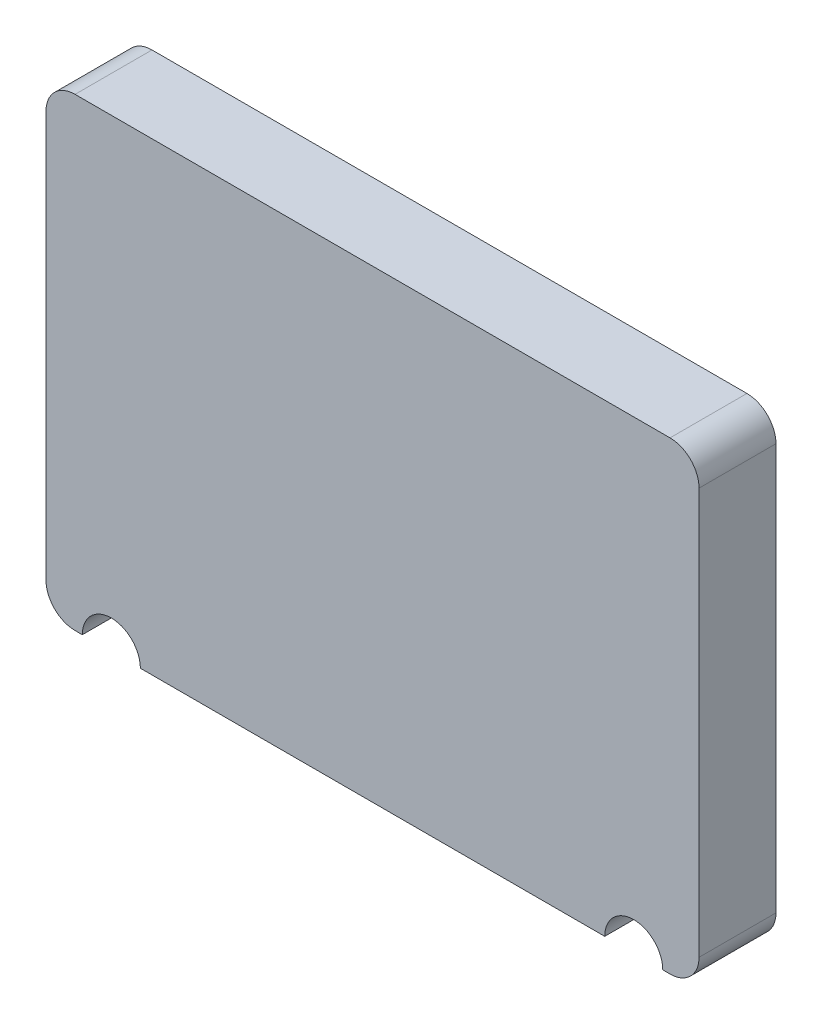
ISO-10303-21;
HEADER;
FILE_DESCRIPTION(('STEP AP214'),'2;1');
FILE_NAME('part.step','',(''),(''),'','','');
FILE_SCHEMA(('AUTOMOTIVE_DESIGN { 1 0 10303 214 1 1 1 1 }'));
ENDSEC;
DATA;
#1=APPLICATION_CONTEXT('core data for automotive mechanical design processes');
#2=APPLICATION_PROTOCOL_DEFINITION('international standard','automotive_design',2000,#1);
#3=PRODUCT_CONTEXT('',#1,'mechanical');
#4=PRODUCT('Part','Part','',(#3));
#5=PRODUCT_RELATED_PRODUCT_CATEGORY('part','',(#4));
#6=PRODUCT_DEFINITION_FORMATION('','',#4);
#7=PRODUCT_DEFINITION_CONTEXT('part definition',#1,'design');
#8=PRODUCT_DEFINITION('design','',#6,#7);
#9=PRODUCT_DEFINITION_SHAPE('','',#8);
#10=(LENGTH_UNIT() NAMED_UNIT(*) SI_UNIT(.MILLI.,.METRE.));
#11=(NAMED_UNIT(*) PLANE_ANGLE_UNIT() SI_UNIT($,.RADIAN.));
#12=(NAMED_UNIT(*) SI_UNIT($,.STERADIAN.) SOLID_ANGLE_UNIT());
#13=UNCERTAINTY_MEASURE_WITH_UNIT(LENGTH_MEASURE(1.E-05),#10,'distance_accuracy_value','');
#14=(GEOMETRIC_REPRESENTATION_CONTEXT(3) GLOBAL_UNCERTAINTY_ASSIGNED_CONTEXT((#13)) GLOBAL_UNIT_ASSIGNED_CONTEXT((#10,
#11,#12)) REPRESENTATION_CONTEXT('',''));
#15=CARTESIAN_POINT('',(0.,0.,0.));
#16=DIRECTION('',(0.,0.,1.));
#17=DIRECTION('',(1.,0.,0.));
#18=AXIS2_PLACEMENT_3D('',#15,#16,#17);
#19=CARTESIAN_POINT('',(-3.,-3.,0.07));
#20=DIRECTION('',(0.,0.,1.));
#21=DIRECTION('',(1.,0.,0.));
#22=AXIS2_PLACEMENT_3D('',#19,#20,#21);
#23=PLANE('',#22);
#24=DIRECTION('',(0.,1.,0.));
#25=VECTOR('',#24,1.);
#26=CARTESIAN_POINT('',(2.25,-1.6,0.07));
#27=LINE('',#26,#25);
#28=CARTESIAN_POINT('',(2.25,-1.4,0.07));
#29=VERTEX_POINT('',#28);
#30=CARTESIAN_POINT('',(2.25,1.4,0.07));
#31=VERTEX_POINT('',#30);
#32=EDGE_CURVE('E132',#29,#31,#27,.T.);
#33=ORIENTED_EDGE('',*,*,#32,.F.);
#34=CARTESIAN_POINT('',(2.05,-1.4,0.07));
#35=DIRECTION('',(0.,0.,1.));
#36=DIRECTION('',(1.,0.,0.));
#37=AXIS2_PLACEMENT_3D('',#34,#35,#36);
#38=CIRCLE('',#37,0.2);
#39=CARTESIAN_POINT('',(2.05,-1.6,0.07));
#40=VERTEX_POINT('',#39);
#41=EDGE_CURVE('E168',#40,#29,#38,.T.);
#42=ORIENTED_EDGE('',*,*,#41,.F.);
#43=DIRECTION('',(1.,0.,0.));
#44=VECTOR('',#43,1.);
#45=CARTESIAN_POINT('',(-2.25,-1.6,0.07));
#46=LINE('',#45,#44);
#47=CARTESIAN_POINT('',(2.,-1.6,0.07));
#48=VERTEX_POINT('',#47);
#49=EDGE_CURVE('E136',#40,#48,#46,.F.);
#50=ORIENTED_EDGE('',*,*,#49,.T.);
#51=CARTESIAN_POINT('',(1.8,-1.6,0.07));
#52=DIRECTION('',(0.,0.,1.));
#53=DIRECTION('',(1.,0.,0.));
#54=AXIS2_PLACEMENT_3D('',#51,#52,#53);
#55=CIRCLE('',#54,0.2);
#56=CARTESIAN_POINT('',(1.6,-1.6,0.07));
#57=VERTEX_POINT('',#56);
#58=EDGE_CURVE('E171',#48,#57,#55,.T.);
#59=ORIENTED_EDGE('',*,*,#58,.T.);
#60=DIRECTION('',(1.,0.,0.));
#61=VECTOR('',#60,1.);
#62=CARTESIAN_POINT('',(-2.25,-1.6,0.07));
#63=LINE('',#62,#61);
#64=CARTESIAN_POINT('',(-1.6,-1.6,0.07));
#65=VERTEX_POINT('',#64);
#66=EDGE_CURVE('E140',#57,#65,#63,.F.);
#67=ORIENTED_EDGE('',*,*,#66,.T.);
#68=CARTESIAN_POINT('',(-1.8,-1.6,0.07));
#69=DIRECTION('',(0.,0.,1.));
#70=DIRECTION('',(1.,0.,0.));
#71=AXIS2_PLACEMENT_3D('',#68,#69,#70);
#72=CIRCLE('',#71,0.2);
#73=CARTESIAN_POINT('',(-2.,-1.6,0.07));
#74=VERTEX_POINT('',#73);
#75=EDGE_CURVE('E172',#65,#74,#72,.T.);
#76=ORIENTED_EDGE('',*,*,#75,.T.);
#77=DIRECTION('',(1.,0.,0.));
#78=VECTOR('',#77,1.);
#79=CARTESIAN_POINT('',(-2.25,-1.6,0.07));
#80=LINE('',#79,#78);
#81=CARTESIAN_POINT('',(-2.05,-1.6,0.07));
#82=VERTEX_POINT('',#81);
#83=EDGE_CURVE('E110',#74,#82,#80,.F.);
#84=ORIENTED_EDGE('',*,*,#83,.T.);
#85=CARTESIAN_POINT('',(-2.05,-1.4,0.07));
#86=DIRECTION('',(0.,0.,1.));
#87=DIRECTION('',(1.,0.,0.));
#88=AXIS2_PLACEMENT_3D('',#85,#86,#87);
#89=CIRCLE('',#88,0.2);
#90=CARTESIAN_POINT('',(-2.25,-1.4,0.07));
#91=VERTEX_POINT('',#90);
#92=EDGE_CURVE('E20',#91,#82,#89,.T.);
#93=ORIENTED_EDGE('',*,*,#92,.F.);
#94=DIRECTION('',(0.,1.,0.));
#95=VECTOR('',#94,1.);
#96=CARTESIAN_POINT('',(-2.25,-1.6,0.07));
#97=LINE('',#96,#95);
#98=CARTESIAN_POINT('',(-2.25,1.4,0.07));
#99=VERTEX_POINT('',#98);
#100=EDGE_CURVE('E108',#91,#99,#97,.T.);
#101=ORIENTED_EDGE('',*,*,#100,.T.);
#102=CARTESIAN_POINT('',(-2.05,1.4,0.07));
#103=DIRECTION('',(0.,0.,1.));
#104=DIRECTION('',(1.,0.,0.));
#105=AXIS2_PLACEMENT_3D('',#102,#103,#104);
#106=CIRCLE('',#105,0.2);
#107=CARTESIAN_POINT('',(-2.05,1.6,0.07));
#108=VERTEX_POINT('',#107);
#109=EDGE_CURVE('E119',#108,#99,#106,.T.);
#110=ORIENTED_EDGE('',*,*,#109,.F.);
#111=DIRECTION('',(1.,0.,0.));
#112=VECTOR('',#111,1.);
#113=CARTESIAN_POINT('',(-2.25,1.6,0.07));
#114=LINE('',#113,#112);
#115=CARTESIAN_POINT('',(2.05,1.6,0.07));
#116=VERTEX_POINT('',#115);
#117=EDGE_CURVE('E128',#116,#108,#114,.F.);
#118=ORIENTED_EDGE('',*,*,#117,.F.);
#119=CARTESIAN_POINT('',(2.05,1.4,0.07));
#120=DIRECTION('',(0.,0.,1.));
#121=DIRECTION('',(1.,0.,0.));
#122=AXIS2_PLACEMENT_3D('',#119,#120,#121);
#123=CIRCLE('',#122,0.2);
#124=EDGE_CURVE('E166',#31,#116,#123,.T.);
#125=ORIENTED_EDGE('',*,*,#124,.F.);
#126=EDGE_LOOP('',(#33,#42,#50,#59,#67,#76,#84,#93,#101,#110,#118,#125));
#127=FACE_BOUND('',#126,.T.);
#128=ADVANCED_FACE('F17',(#127),#23,.F.);
#129=CARTESIAN_POINT('',(-2.05,-1.4,0.));
#130=DIRECTION('',(0.,0.,1.));
#131=DIRECTION('',(1.,0.,0.));
#132=AXIS2_PLACEMENT_3D('',#129,#130,#131);
#133=CYLINDRICAL_SURFACE('',#132,0.2);
#134=DIRECTION('',(0.,0.,-1.));
#135=VECTOR('',#134,1.);
#136=CARTESIAN_POINT('',(-2.25,-1.4,0.));
#137=LINE('',#136,#135);
#138=CARTESIAN_POINT('',(-2.25,-1.4,0.6));
#139=VERTEX_POINT('',#138);
#140=EDGE_CURVE('E114',#139,#91,#137,.T.);
#141=ORIENTED_EDGE('',*,*,#140,.T.);
#142=ORIENTED_EDGE('',*,*,#92,.T.);
#143=DIRECTION('',(0.,0.,1.));
#144=VECTOR('',#143,1.);
#145=CARTESIAN_POINT('',(-2.05,-1.6,0.));
#146=LINE('',#145,#144);
#147=CARTESIAN_POINT('',(-2.05,-1.6,0.6));
#148=VERTEX_POINT('',#147);
#149=EDGE_CURVE('E126',#82,#148,#146,.T.);
#150=ORIENTED_EDGE('',*,*,#149,.T.);
#151=CARTESIAN_POINT('',(-2.05,-1.4,0.6));
#152=DIRECTION('',(0.,0.,1.));
#153=DIRECTION('',(1.,0.,0.));
#154=AXIS2_PLACEMENT_3D('',#151,#152,#153);
#155=CIRCLE('',#154,0.2);
#156=EDGE_CURVE('E117',#139,#148,#155,.T.);
#157=ORIENTED_EDGE('',*,*,#156,.F.);
#158=EDGE_LOOP('',(#141,#142,#150,#157));
#159=FACE_BOUND('',#158,.T.);
#160=ADVANCED_FACE('F115',(#159),#133,.T.);
#161=CARTESIAN_POINT('',(-2.25,-1.6,0.));
#162=DIRECTION('',(0.,1.,0.));
#163=DIRECTION('',(0.,0.,1.));
#164=AXIS2_PLACEMENT_3D('',#161,#162,#163);
#165=PLANE('',#164);
#166=ORIENTED_EDGE('',*,*,#149,.F.);
#167=ORIENTED_EDGE('',*,*,#83,.F.);
#168=DIRECTION('',(0.,0.,1.));
#169=VECTOR('',#168,1.);
#170=CARTESIAN_POINT('',(-2.,-1.6,0.));
#171=LINE('',#170,#169);
#172=CARTESIAN_POINT('',(-2.,-1.6,0.6));
#173=VERTEX_POINT('',#172);
#174=EDGE_CURVE('E143',#74,#173,#171,.T.);
#175=ORIENTED_EDGE('',*,*,#174,.T.);
#176=DIRECTION('',(1.,0.,0.));
#177=VECTOR('',#176,1.);
#178=CARTESIAN_POINT('',(-2.25,-1.6,0.6));
#179=LINE('',#178,#177);
#180=EDGE_CURVE('E163',#148,#173,#179,.T.);
#181=ORIENTED_EDGE('',*,*,#180,.F.);
#182=EDGE_LOOP('',(#166,#167,#175,#181));
#183=FACE_BOUND('',#182,.T.);
#184=ADVANCED_FACE('F177',(#183),#165,.F.);
#185=CARTESIAN_POINT('',(-1.8,-1.6,0.));
#186=DIRECTION('',(0.,0.,1.));
#187=DIRECTION('',(1.,0.,0.));
#188=AXIS2_PLACEMENT_3D('',#185,#186,#187);
#189=CYLINDRICAL_SURFACE('',#188,0.2);
#190=ORIENTED_EDGE('',*,*,#75,.F.);
#191=DIRECTION('',(0.,0.,1.));
#192=VECTOR('',#191,1.);
#193=CARTESIAN_POINT('',(-1.6,-1.6,0.));
#194=LINE('',#193,#192);
#195=CARTESIAN_POINT('',(-1.6,-1.6,0.6));
#196=VERTEX_POINT('',#195);
#197=EDGE_CURVE('E142',#65,#196,#194,.T.);
#198=ORIENTED_EDGE('',*,*,#197,.T.);
#199=CARTESIAN_POINT('',(-1.8,-1.6,0.6));
#200=DIRECTION('',(0.,0.,1.));
#201=DIRECTION('',(1.,0.,0.));
#202=AXIS2_PLACEMENT_3D('',#199,#200,#201);
#203=CIRCLE('',#202,0.2);
#204=EDGE_CURVE('E160',#173,#196,#203,.F.);
#205=ORIENTED_EDGE('',*,*,#204,.F.);
#206=ORIENTED_EDGE('',*,*,#174,.F.);
#207=EDGE_LOOP('',(#190,#198,#205,#206));
#208=FACE_BOUND('',#207,.T.);
#209=ADVANCED_FACE('F203',(#208),#189,.F.);
#210=CARTESIAN_POINT('',(-2.25,-1.6,0.));
#211=DIRECTION('',(0.,1.,0.));
#212=DIRECTION('',(0.,0.,1.));
#213=AXIS2_PLACEMENT_3D('',#210,#211,#212);
#214=PLANE('',#213);
#215=ORIENTED_EDGE('',*,*,#197,.F.);
#216=ORIENTED_EDGE('',*,*,#66,.F.);
#217=DIRECTION('',(0.,0.,1.));
#218=VECTOR('',#217,1.);
#219=CARTESIAN_POINT('',(1.6,-1.6,0.));
#220=LINE('',#219,#218);
#221=CARTESIAN_POINT('',(1.6,-1.6,0.6));
#222=VERTEX_POINT('',#221);
#223=EDGE_CURVE('E139',#57,#222,#220,.T.);
#224=ORIENTED_EDGE('',*,*,#223,.T.);
#225=DIRECTION('',(1.,0.,0.));
#226=VECTOR('',#225,1.);
#227=CARTESIAN_POINT('',(-2.25,-1.6,0.6));
#228=LINE('',#227,#226);
#229=EDGE_CURVE('E159',#196,#222,#228,.T.);
#230=ORIENTED_EDGE('',*,*,#229,.F.);
#231=EDGE_LOOP('',(#215,#216,#224,#230));
#232=FACE_BOUND('',#231,.T.);
#233=ADVANCED_FACE('F207',(#232),#214,.F.);
#234=CARTESIAN_POINT('',(1.8,-1.6,0.));
#235=DIRECTION('',(0.,0.,1.));
#236=DIRECTION('',(1.,0.,0.));
#237=AXIS2_PLACEMENT_3D('',#234,#235,#236);
#238=CYLINDRICAL_SURFACE('',#237,0.2);
#239=ORIENTED_EDGE('',*,*,#58,.F.);
#240=DIRECTION('',(0.,0.,1.));
#241=VECTOR('',#240,1.);
#242=CARTESIAN_POINT('',(2.,-1.6,0.));
#243=LINE('',#242,#241);
#244=CARTESIAN_POINT('',(2.,-1.6,0.6));
#245=VERTEX_POINT('',#244);
#246=EDGE_CURVE('E138',#48,#245,#243,.T.);
#247=ORIENTED_EDGE('',*,*,#246,.T.);
#248=CARTESIAN_POINT('',(1.8,-1.6,0.6));
#249=DIRECTION('',(0.,0.,1.));
#250=DIRECTION('',(1.,0.,0.));
#251=AXIS2_PLACEMENT_3D('',#248,#249,#250);
#252=CIRCLE('',#251,0.2);
#253=EDGE_CURVE('E156',#222,#245,#252,.F.);
#254=ORIENTED_EDGE('',*,*,#253,.F.);
#255=ORIENTED_EDGE('',*,*,#223,.F.);
#256=EDGE_LOOP('',(#239,#247,#254,#255));
#257=FACE_BOUND('',#256,.T.);
#258=ADVANCED_FACE('F289',(#257),#238,.F.);
#259=CARTESIAN_POINT('',(-2.25,-1.6,0.));
#260=DIRECTION('',(0.,1.,0.));
#261=DIRECTION('',(0.,0.,1.));
#262=AXIS2_PLACEMENT_3D('',#259,#260,#261);
#263=PLANE('',#262);
#264=ORIENTED_EDGE('',*,*,#246,.F.);
#265=ORIENTED_EDGE('',*,*,#49,.F.);
#266=DIRECTION('',(0.,0.,1.));
#267=VECTOR('',#266,1.);
#268=CARTESIAN_POINT('',(2.05,-1.6,0.));
#269=LINE('',#268,#267);
#270=CARTESIAN_POINT('',(2.05,-1.6,0.6));
#271=VERTEX_POINT('',#270);
#272=EDGE_CURVE('E170',#271,#40,#269,.F.);
#273=ORIENTED_EDGE('',*,*,#272,.F.);
#274=DIRECTION('',(1.,0.,0.));
#275=VECTOR('',#274,1.);
#276=CARTESIAN_POINT('',(-2.25,-1.6,0.6));
#277=LINE('',#276,#275);
#278=EDGE_CURVE('E155',#245,#271,#277,.T.);
#279=ORIENTED_EDGE('',*,*,#278,.F.);
#280=EDGE_LOOP('',(#264,#265,#273,#279));
#281=FACE_BOUND('',#280,.T.);
#282=ADVANCED_FACE('F279',(#281),#263,.F.);
#283=CARTESIAN_POINT('',(2.05,-1.4,0.));
#284=DIRECTION('',(0.,0.,1.));
#285=DIRECTION('',(1.,0.,0.));
#286=AXIS2_PLACEMENT_3D('',#283,#284,#285);
#287=CYLINDRICAL_SURFACE('',#286,0.2);
#288=DIRECTION('',(0.,0.,-1.));
#289=VECTOR('',#288,1.);
#290=CARTESIAN_POINT('',(2.25,-1.4,0.));
#291=LINE('',#290,#289);
#292=CARTESIAN_POINT('',(2.25,-1.4,0.6));
#293=VERTEX_POINT('',#292);
#294=EDGE_CURVE('E135',#293,#29,#291,.T.);
#295=ORIENTED_EDGE('',*,*,#294,.F.);
#296=CARTESIAN_POINT('',(2.05,-1.4,0.6));
#297=DIRECTION('',(0.,0.,1.));
#298=DIRECTION('',(1.,0.,0.));
#299=AXIS2_PLACEMENT_3D('',#296,#297,#298);
#300=CIRCLE('',#299,0.2);
#301=EDGE_CURVE('E152',#271,#293,#300,.T.);
#302=ORIENTED_EDGE('',*,*,#301,.F.);
#303=ORIENTED_EDGE('',*,*,#272,.T.);
#304=ORIENTED_EDGE('',*,*,#41,.T.);
#305=EDGE_LOOP('',(#295,#302,#303,#304));
#306=FACE_BOUND('',#305,.T.);
#307=ADVANCED_FACE('F270',(#306),#287,.T.);
#308=CARTESIAN_POINT('',(2.25,-1.6,0.));
#309=DIRECTION('',(1.,0.,0.));
#310=DIRECTION('',(0.,0.,-1.));
#311=AXIS2_PLACEMENT_3D('',#308,#309,#310);
#312=PLANE('',#311);
#313=ORIENTED_EDGE('',*,*,#32,.T.);
#314=DIRECTION('',(0.,0.,1.));
#315=VECTOR('',#314,1.);
#316=CARTESIAN_POINT('',(2.25,1.4,0.));
#317=LINE('',#316,#315);
#318=CARTESIAN_POINT('',(2.25,1.4,0.6));
#319=VERTEX_POINT('',#318);
#320=EDGE_CURVE('E134',#319,#31,#317,.F.);
#321=ORIENTED_EDGE('',*,*,#320,.F.);
#322=DIRECTION('',(0.,1.,0.));
#323=VECTOR('',#322,1.);
#324=CARTESIAN_POINT('',(2.25,-1.6,0.6));
#325=LINE('',#324,#323);
#326=EDGE_CURVE('E151',#293,#319,#325,.T.);
#327=ORIENTED_EDGE('',*,*,#326,.F.);
#328=ORIENTED_EDGE('',*,*,#294,.T.);
#329=EDGE_LOOP('',(#313,#321,#327,#328));
#330=FACE_BOUND('',#329,.T.);
#331=ADVANCED_FACE('F220',(#330),#312,.T.);
#332=CARTESIAN_POINT('',(2.05,1.4,0.));
#333=DIRECTION('',(0.,0.,1.));
#334=DIRECTION('',(1.,0.,0.));
#335=AXIS2_PLACEMENT_3D('',#332,#333,#334);
#336=CYLINDRICAL_SURFACE('',#335,0.2);
#337=ORIENTED_EDGE('',*,*,#320,.T.);
#338=ORIENTED_EDGE('',*,*,#124,.T.);
#339=DIRECTION('',(0.,0.,1.));
#340=VECTOR('',#339,1.);
#341=CARTESIAN_POINT('',(2.05,1.6,0.));
#342=LINE('',#341,#340);
#343=CARTESIAN_POINT('',(2.05,1.6,0.6));
#344=VERTEX_POINT('',#343);
#345=EDGE_CURVE('E131',#344,#116,#342,.F.);
#346=ORIENTED_EDGE('',*,*,#345,.F.);
#347=CARTESIAN_POINT('',(2.05,1.4,0.6));
#348=DIRECTION('',(0.,0.,1.));
#349=DIRECTION('',(1.,0.,0.));
#350=AXIS2_PLACEMENT_3D('',#347,#348,#349);
#351=CIRCLE('',#350,0.2);
#352=EDGE_CURVE('E148',#319,#344,#351,.T.);
#353=ORIENTED_EDGE('',*,*,#352,.F.);
#354=EDGE_LOOP('',(#337,#338,#346,#353));
#355=FACE_BOUND('',#354,.T.);
#356=ADVANCED_FACE('F223',(#355),#336,.T.);
#357=CARTESIAN_POINT('',(-2.25,1.6,0.));
#358=DIRECTION('',(0.,1.,0.));
#359=DIRECTION('',(0.,0.,1.));
#360=AXIS2_PLACEMENT_3D('',#357,#358,#359);
#361=PLANE('',#360);
#362=ORIENTED_EDGE('',*,*,#117,.T.);
#363=DIRECTION('',(0.,0.,1.));
#364=VECTOR('',#363,1.);
#365=CARTESIAN_POINT('',(-2.05,1.6,0.));
#366=LINE('',#365,#364);
#367=CARTESIAN_POINT('',(-2.05,1.6,0.6));
#368=VERTEX_POINT('',#367);
#369=EDGE_CURVE('E130',#368,#108,#366,.F.);
#370=ORIENTED_EDGE('',*,*,#369,.F.);
#371=DIRECTION('',(1.,0.,0.));
#372=VECTOR('',#371,1.);
#373=CARTESIAN_POINT('',(-2.25,1.6,0.6));
#374=LINE('',#373,#372);
#375=EDGE_CURVE('E147',#344,#368,#374,.F.);
#376=ORIENTED_EDGE('',*,*,#375,.F.);
#377=ORIENTED_EDGE('',*,*,#345,.T.);
#378=EDGE_LOOP('',(#362,#370,#376,#377));
#379=FACE_BOUND('',#378,.T.);
#380=ADVANCED_FACE('F225',(#379),#361,.T.);
#381=CARTESIAN_POINT('',(-2.05,1.4,0.));
#382=DIRECTION('',(0.,0.,1.));
#383=DIRECTION('',(1.,0.,0.));
#384=AXIS2_PLACEMENT_3D('',#381,#382,#383);
#385=CYLINDRICAL_SURFACE('',#384,0.2);
#386=DIRECTION('',(0.,0.,-1.));
#387=VECTOR('',#386,1.);
#388=CARTESIAN_POINT('',(-2.25,1.4,0.));
#389=LINE('',#388,#387);
#390=CARTESIAN_POINT('',(-2.25,1.4,0.6));
#391=VERTEX_POINT('',#390);
#392=EDGE_CURVE('E35',#99,#391,#389,.F.);
#393=ORIENTED_EDGE('',*,*,#392,.T.);
#394=CARTESIAN_POINT('',(-2.05,1.4,0.6));
#395=DIRECTION('',(0.,0.,1.));
#396=DIRECTION('',(1.,0.,0.));
#397=AXIS2_PLACEMENT_3D('',#394,#395,#396);
#398=CIRCLE('',#397,0.2);
#399=EDGE_CURVE('E26',#368,#391,#398,.T.);
#400=ORIENTED_EDGE('',*,*,#399,.F.);
#401=ORIENTED_EDGE('',*,*,#369,.T.);
#402=ORIENTED_EDGE('',*,*,#109,.T.);
#403=EDGE_LOOP('',(#393,#400,#401,#402));
#404=FACE_BOUND('',#403,.T.);
#405=ADVANCED_FACE('F186',(#404),#385,.T.);
#406=CARTESIAN_POINT('',(-2.25,-1.6,0.));
#407=DIRECTION('',(1.,0.,0.));
#408=DIRECTION('',(0.,0.,-1.));
#409=AXIS2_PLACEMENT_3D('',#406,#407,#408);
#410=PLANE('',#409);
#411=ORIENTED_EDGE('',*,*,#392,.F.);
#412=ORIENTED_EDGE('',*,*,#100,.F.);
#413=ORIENTED_EDGE('',*,*,#140,.F.);
#414=DIRECTION('',(0.,1.,0.));
#415=VECTOR('',#414,1.);
#416=CARTESIAN_POINT('',(-2.25,-1.6,0.6));
#417=LINE('',#416,#415);
#418=EDGE_CURVE('E11',#391,#139,#417,.F.);
#419=ORIENTED_EDGE('',*,*,#418,.F.);
#420=EDGE_LOOP('',(#411,#412,#413,#419));
#421=FACE_BOUND('',#420,.T.);
#422=ADVANCED_FACE('F121',(#421),#410,.F.);
#423=CARTESIAN_POINT('',(-2.25,-1.6,0.6));
#424=DIRECTION('',(0.,0.,1.));
#425=DIRECTION('',(1.,0.,0.));
#426=AXIS2_PLACEMENT_3D('',#423,#424,#425);
#427=PLANE('',#426);
#428=ORIENTED_EDGE('',*,*,#399,.T.);
#429=ORIENTED_EDGE('',*,*,#418,.T.);
#430=ORIENTED_EDGE('',*,*,#156,.T.);
#431=ORIENTED_EDGE('',*,*,#180,.T.);
#432=ORIENTED_EDGE('',*,*,#204,.T.);
#433=ORIENTED_EDGE('',*,*,#229,.T.);
#434=ORIENTED_EDGE('',*,*,#253,.T.);
#435=ORIENTED_EDGE('',*,*,#278,.T.);
#436=ORIENTED_EDGE('',*,*,#301,.T.);
#437=ORIENTED_EDGE('',*,*,#326,.T.);
#438=ORIENTED_EDGE('',*,*,#352,.T.);
#439=ORIENTED_EDGE('',*,*,#375,.T.);
#440=EDGE_LOOP('',(#428,#429,#430,#431,#432,#433,#434,#435,#436,#437,#438,#439));
#441=FACE_BOUND('',#440,.T.);
#442=ADVANCED_FACE('F182',(#441),#427,.T.);
#443=CLOSED_SHELL('',(#128,#160,#184,#209,#233,#258,#282,#307,#331,#356,#380,#405,#422,#442));
#444=MANIFOLD_SOLID_BREP('B1',#443);
#445=ADVANCED_BREP_SHAPE_REPRESENTATION('',(#18,#444),#14);
#446=SHAPE_DEFINITION_REPRESENTATION(#9,#445);
ENDSEC;
END-ISO-10303-21;
